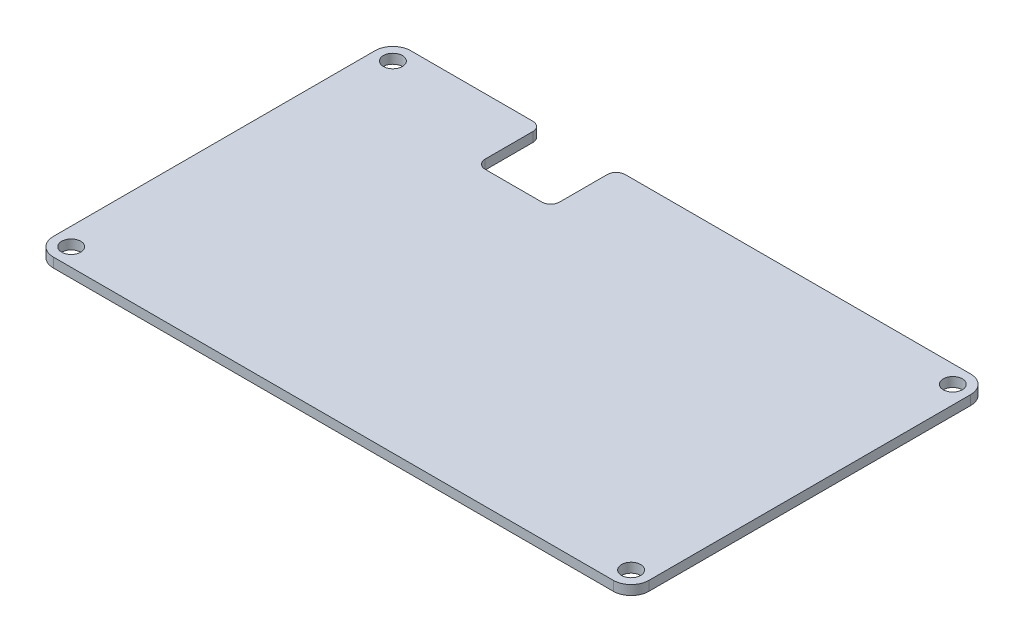
ISO-10303-21;
HEADER;
FILE_DESCRIPTION(('STEP AP214'),'2;1');
FILE_NAME('part.step','',(''),(''),'','','');
FILE_SCHEMA(('AUTOMOTIVE_DESIGN { 1 0 10303 214 1 1 1 1 }'));
ENDSEC;
DATA;
#1=APPLICATION_CONTEXT('core data for automotive mechanical design processes');
#2=APPLICATION_PROTOCOL_DEFINITION('international standard','automotive_design',2000,#1);
#3=PRODUCT_CONTEXT('',#1,'mechanical');
#4=PRODUCT('Part','Part','',(#3));
#5=PRODUCT_RELATED_PRODUCT_CATEGORY('part','',(#4));
#6=PRODUCT_DEFINITION_FORMATION('','',#4);
#7=PRODUCT_DEFINITION_CONTEXT('part definition',#1,'design');
#8=PRODUCT_DEFINITION('design','',#6,#7);
#9=PRODUCT_DEFINITION_SHAPE('','',#8);
#10=(LENGTH_UNIT() NAMED_UNIT(*) SI_UNIT(.MILLI.,.METRE.));
#11=(NAMED_UNIT(*) PLANE_ANGLE_UNIT() SI_UNIT($,.RADIAN.));
#12=(NAMED_UNIT(*) SI_UNIT($,.STERADIAN.) SOLID_ANGLE_UNIT());
#13=UNCERTAINTY_MEASURE_WITH_UNIT(LENGTH_MEASURE(1.E-05),#10,'distance_accuracy_value','');
#14=(GEOMETRIC_REPRESENTATION_CONTEXT(3) GLOBAL_UNCERTAINTY_ASSIGNED_CONTEXT((#13)) GLOBAL_UNIT_ASSIGNED_CONTEXT((#10,
#11,#12)) REPRESENTATION_CONTEXT('',''));
#15=CARTESIAN_POINT('',(0.,0.,0.));
#16=DIRECTION('',(0.,0.,1.));
#17=DIRECTION('',(1.,0.,0.));
#18=AXIS2_PLACEMENT_3D('',#15,#16,#17);
#19=CARTESIAN_POINT('',(-50.,1.6,-30.));
#20=DIRECTION('',(0.,0.,-1.));
#21=DIRECTION('',(-1.,0.,0.));
#22=AXIS2_PLACEMENT_3D('',#19,#20,#21);
#23=PLANE('',#22);
#24=DIRECTION('',(1.,0.,0.));
#25=VECTOR('',#24,1.);
#26=CARTESIAN_POINT('',(-50.,1.6,-30.));
#27=LINE('',#26,#25);
#28=CARTESIAN_POINT('',(-47.,1.6,-30.));
#29=VERTEX_POINT('',#28);
#30=CARTESIAN_POINT('',(-26.5,1.6,-30.));
#31=VERTEX_POINT('',#30);
#32=EDGE_CURVE('E156',#29,#31,#27,.T.);
#33=ORIENTED_EDGE('',*,*,#32,.T.);
#34=DIRECTION('',(0.,1.,0.));
#35=VECTOR('',#34,1.);
#36=CARTESIAN_POINT('',(-26.5,0.,-30.));
#37=LINE('',#36,#35);
#38=CARTESIAN_POINT('',(-26.5,0.,-30.));
#39=VERTEX_POINT('',#38);
#40=EDGE_CURVE('E227',#31,#39,#37,.F.);
#41=ORIENTED_EDGE('',*,*,#40,.T.);
#42=DIRECTION('',(1.,0.,0.));
#43=VECTOR('',#42,1.);
#44=CARTESIAN_POINT('',(-50.,0.,-30.));
#45=LINE('',#44,#43);
#46=CARTESIAN_POINT('',(-47.,0.,-30.));
#47=VERTEX_POINT('',#46);
#48=EDGE_CURVE('E298',#47,#39,#45,.T.);
#49=ORIENTED_EDGE('',*,*,#48,.F.);
#50=DIRECTION('',(0.,-1.,0.));
#51=VECTOR('',#50,1.);
#52=CARTESIAN_POINT('',(-47.,1.6,-30.));
#53=LINE('',#52,#51);
#54=EDGE_CURVE('E206',#47,#29,#53,.F.);
#55=ORIENTED_EDGE('',*,*,#54,.T.);
#56=EDGE_LOOP('',(#33,#41,#49,#55));
#57=FACE_BOUND('',#56,.T.);
#58=ADVANCED_FACE('F33',(#57),#23,.T.);
#59=CARTESIAN_POINT('',(-50.,1.6,30.));
#60=DIRECTION('',(0.,0.,-1.));
#61=DIRECTION('',(-1.,0.,0.));
#62=AXIS2_PLACEMENT_3D('',#59,#60,#61);
#63=PLANE('',#62);
#64=DIRECTION('',(1.,0.,0.));
#65=VECTOR('',#64,1.);
#66=CARTESIAN_POINT('',(-50.,0.,30.));
#67=LINE('',#66,#65);
#68=CARTESIAN_POINT('',(-47.,0.,30.));
#69=VERTEX_POINT('',#68);
#70=CARTESIAN_POINT('',(47.,0.,30.));
#71=VERTEX_POINT('',#70);
#72=EDGE_CURVE('E285',#69,#71,#67,.T.);
#73=ORIENTED_EDGE('',*,*,#72,.T.);
#74=DIRECTION('',(0.,-1.,0.));
#75=VECTOR('',#74,1.);
#76=CARTESIAN_POINT('',(47.,1.6,30.));
#77=LINE('',#76,#75);
#78=CARTESIAN_POINT('',(47.,1.6,30.));
#79=VERTEX_POINT('',#78);
#80=EDGE_CURVE('E199',#71,#79,#77,.F.);
#81=ORIENTED_EDGE('',*,*,#80,.T.);
#82=DIRECTION('',(1.,0.,0.));
#83=VECTOR('',#82,1.);
#84=CARTESIAN_POINT('',(-50.,1.6,30.));
#85=LINE('',#84,#83);
#86=CARTESIAN_POINT('',(-47.,1.6,30.));
#87=VERTEX_POINT('',#86);
#88=EDGE_CURVE('E288',#87,#79,#85,.T.);
#89=ORIENTED_EDGE('',*,*,#88,.F.);
#90=DIRECTION('',(0.,-1.,0.));
#91=VECTOR('',#90,1.);
#92=CARTESIAN_POINT('',(-47.,1.6,30.));
#93=LINE('',#92,#91);
#94=EDGE_CURVE('E166',#87,#69,#93,.T.);
#95=ORIENTED_EDGE('',*,*,#94,.T.);
#96=EDGE_LOOP('',(#73,#81,#89,#95));
#97=FACE_BOUND('',#96,.T.);
#98=ADVANCED_FACE('F326',(#97),#63,.F.);
#99=CARTESIAN_POINT('',(50.,1.6,-30.));
#100=DIRECTION('',(1.,0.,0.));
#101=DIRECTION('',(0.,0.,-1.));
#102=AXIS2_PLACEMENT_3D('',#99,#100,#101);
#103=PLANE('',#102);
#104=DIRECTION('',(0.,0.,1.));
#105=VECTOR('',#104,1.);
#106=CARTESIAN_POINT('',(50.,0.,-30.));
#107=LINE('',#106,#105);
#108=CARTESIAN_POINT('',(50.,0.,-27.));
#109=VERTEX_POINT('',#108);
#110=CARTESIAN_POINT('',(50.,0.,27.));
#111=VERTEX_POINT('',#110);
#112=EDGE_CURVE('E295',#109,#111,#107,.T.);
#113=ORIENTED_EDGE('',*,*,#112,.F.);
#114=DIRECTION('',(0.,-1.,0.));
#115=VECTOR('',#114,1.);
#116=CARTESIAN_POINT('',(50.,1.6,-27.));
#117=LINE('',#116,#115);
#118=CARTESIAN_POINT('',(50.,1.6,-27.));
#119=VERTEX_POINT('',#118);
#120=EDGE_CURVE('E190',#109,#119,#117,.F.);
#121=ORIENTED_EDGE('',*,*,#120,.T.);
#122=DIRECTION('',(0.,0.,1.));
#123=VECTOR('',#122,1.);
#124=CARTESIAN_POINT('',(50.,1.6,-30.));
#125=LINE('',#124,#123);
#126=CARTESIAN_POINT('',(50.,1.6,27.));
#127=VERTEX_POINT('',#126);
#128=EDGE_CURVE('E157',#119,#127,#125,.T.);
#129=ORIENTED_EDGE('',*,*,#128,.T.);
#130=DIRECTION('',(0.,-1.,0.));
#131=VECTOR('',#130,1.);
#132=CARTESIAN_POINT('',(50.,0.,27.));
#133=LINE('',#132,#131);
#134=EDGE_CURVE('E187',#127,#111,#133,.T.);
#135=ORIENTED_EDGE('',*,*,#134,.T.);
#136=EDGE_LOOP('',(#113,#121,#129,#135));
#137=FACE_BOUND('',#136,.T.);
#138=ADVANCED_FACE('F332',(#137),#103,.T.);
#139=CARTESIAN_POINT('',(-11.,0.,-30.));
#140=VERTEX_POINT('',#139);
#141=CARTESIAN_POINT('',(47.,0.,-30.));
#142=VERTEX_POINT('',#141);
#143=EDGE_CURVE('E297',#140,#142,#45,.T.);
#144=ORIENTED_EDGE('',*,*,#143,.F.);
#145=DIRECTION('',(0.,1.,0.));
#146=VECTOR('',#145,1.);
#147=CARTESIAN_POINT('',(-11.,1.6,-30.));
#148=LINE('',#147,#146);
#149=CARTESIAN_POINT('',(-11.,1.6,-30.));
#150=VERTEX_POINT('',#149);
#151=EDGE_CURVE('E154',#140,#150,#148,.T.);
#152=ORIENTED_EDGE('',*,*,#151,.T.);
#153=CARTESIAN_POINT('',(47.,1.6,-30.));
#154=VERTEX_POINT('',#153);
#155=EDGE_CURVE('E147',#150,#154,#27,.T.);
#156=ORIENTED_EDGE('',*,*,#155,.T.);
#157=DIRECTION('',(0.,-1.,0.));
#158=VECTOR('',#157,1.);
#159=CARTESIAN_POINT('',(47.,1.6,-30.));
#160=LINE('',#159,#158);
#161=EDGE_CURVE('E152',#154,#142,#160,.T.);
#162=ORIENTED_EDGE('',*,*,#161,.T.);
#163=EDGE_LOOP('',(#144,#152,#156,#162));
#164=FACE_BOUND('',#163,.T.);
#165=ADVANCED_FACE('F150',(#164),#23,.T.);
#166=CARTESIAN_POINT('',(-50.,1.6,-30.));
#167=DIRECTION('',(1.,0.,0.));
#168=DIRECTION('',(0.,0.,-1.));
#169=AXIS2_PLACEMENT_3D('',#166,#167,#168);
#170=PLANE('',#169);
#171=DIRECTION('',(0.,0.,1.));
#172=VECTOR('',#171,1.);
#173=CARTESIAN_POINT('',(-50.,0.,-30.));
#174=LINE('',#173,#172);
#175=CARTESIAN_POINT('',(-50.,0.,-27.));
#176=VERTEX_POINT('',#175);
#177=CARTESIAN_POINT('',(-50.,0.,27.));
#178=VERTEX_POINT('',#177);
#179=EDGE_CURVE('E180',#176,#178,#174,.T.);
#180=ORIENTED_EDGE('',*,*,#179,.T.);
#181=DIRECTION('',(0.,-1.,0.));
#182=VECTOR('',#181,1.);
#183=CARTESIAN_POINT('',(-50.,1.6,27.));
#184=LINE('',#183,#182);
#185=CARTESIAN_POINT('',(-50.,1.6,27.));
#186=VERTEX_POINT('',#185);
#187=EDGE_CURVE('E204',#178,#186,#184,.F.);
#188=ORIENTED_EDGE('',*,*,#187,.T.);
#189=DIRECTION('',(0.,0.,1.));
#190=VECTOR('',#189,1.);
#191=CARTESIAN_POINT('',(-50.,1.6,-30.));
#192=LINE('',#191,#190);
#193=CARTESIAN_POINT('',(-50.,1.6,-27.));
#194=VERTEX_POINT('',#193);
#195=EDGE_CURVE('E173',#194,#186,#192,.T.);
#196=ORIENTED_EDGE('',*,*,#195,.F.);
#197=DIRECTION('',(0.,-1.,0.));
#198=VECTOR('',#197,1.);
#199=CARTESIAN_POINT('',(-50.,0.,-27.));
#200=LINE('',#199,#198);
#201=EDGE_CURVE('E201',#194,#176,#200,.T.);
#202=ORIENTED_EDGE('',*,*,#201,.T.);
#203=EDGE_LOOP('',(#180,#188,#196,#202));
#204=FACE_BOUND('',#203,.T.);
#205=ADVANCED_FACE('F338',(#204),#170,.F.);
#206=CARTESIAN_POINT('',(0.,1.6,0.));
#207=DIRECTION('',(0.,-1.,0.));
#208=DIRECTION('',(0.,0.,-1.));
#209=AXIS2_PLACEMENT_3D('',#206,#207,#208);
#210=PLANE('',#209);
#211=CARTESIAN_POINT('',(-47.,1.6,27.));
#212=DIRECTION('',(0.,1.,0.));
#213=DIRECTION('',(0.,0.,-1.));
#214=AXIS2_PLACEMENT_3D('',#211,#212,#213);
#215=CIRCLE('',#214,1.6);
#216=CARTESIAN_POINT('',(-47.,1.6,25.4));
#217=VERTEX_POINT('',#216);
#218=EDGE_CURVE('E256',#217,#217,#215,.T.);
#219=ORIENTED_EDGE('',*,*,#218,.F.);
#220=EDGE_LOOP('',(#219));
#221=FACE_BOUND('',#220,.T.);
#222=CARTESIAN_POINT('',(47.,1.6,27.));
#223=DIRECTION('',(0.,1.,0.));
#224=DIRECTION('',(0.,0.,1.));
#225=AXIS2_PLACEMENT_3D('',#222,#223,#224);
#226=CIRCLE('',#225,1.6);
#227=CARTESIAN_POINT('',(47.,1.6,28.6));
#228=VERTEX_POINT('',#227);
#229=EDGE_CURVE('E274',#228,#228,#226,.T.);
#230=ORIENTED_EDGE('',*,*,#229,.F.);
#231=EDGE_LOOP('',(#230));
#232=FACE_BOUND('',#231,.T.);
#233=CARTESIAN_POINT('',(47.,1.6,-27.));
#234=DIRECTION('',(0.,1.,0.));
#235=DIRECTION('',(0.,0.,-1.));
#236=AXIS2_PLACEMENT_3D('',#233,#234,#235);
#237=CIRCLE('',#236,1.6);
#238=CARTESIAN_POINT('',(47.,1.6,-28.6));
#239=VERTEX_POINT('',#238);
#240=EDGE_CURVE('E268',#239,#239,#237,.T.);
#241=ORIENTED_EDGE('',*,*,#240,.F.);
#242=EDGE_LOOP('',(#241));
#243=FACE_BOUND('',#242,.T.);
#244=CARTESIAN_POINT('',(-47.,1.6,-27.));
#245=DIRECTION('',(0.,1.,0.));
#246=DIRECTION('',(0.,0.,1.));
#247=AXIS2_PLACEMENT_3D('',#244,#245,#246);
#248=CIRCLE('',#247,1.6);
#249=CARTESIAN_POINT('',(-47.,1.6,-25.4));
#250=VERTEX_POINT('',#249);
#251=EDGE_CURVE('E267',#250,#250,#248,.T.);
#252=ORIENTED_EDGE('',*,*,#251,.F.);
#253=EDGE_LOOP('',(#252));
#254=FACE_BOUND('',#253,.T.);
#255=ORIENTED_EDGE('',*,*,#155,.F.);
#256=CARTESIAN_POINT('',(-11.,1.6,-28.5));
#257=DIRECTION('',(0.,-1.,0.));
#258=DIRECTION('',(0.,0.,-1.));
#259=AXIS2_PLACEMENT_3D('',#256,#257,#258);
#260=CIRCLE('',#259,1.5);
#261=CARTESIAN_POINT('',(-12.5,1.6,-28.5));
#262=VERTEX_POINT('',#261);
#263=EDGE_CURVE('E211',#150,#262,#260,.F.);
#264=ORIENTED_EDGE('',*,*,#263,.T.);
#265=DIRECTION('',(0.,0.,-1.));
#266=VECTOR('',#265,1.);
#267=CARTESIAN_POINT('',(-12.5,1.6,-30.));
#268=LINE('',#267,#266);
#269=CARTESIAN_POINT('',(-12.5,1.6,-20.5));
#270=VERTEX_POINT('',#269);
#271=EDGE_CURVE('E258',#270,#262,#268,.T.);
#272=ORIENTED_EDGE('',*,*,#271,.F.);
#273=CARTESIAN_POINT('',(-14.,1.6,-20.5));
#274=DIRECTION('',(0.,-1.,0.));
#275=DIRECTION('',(0.,0.,-1.));
#276=AXIS2_PLACEMENT_3D('',#273,#274,#275);
#277=CIRCLE('',#276,1.5);
#278=CARTESIAN_POINT('',(-14.,1.6,-19.));
#279=VERTEX_POINT('',#278);
#280=EDGE_CURVE('E233',#270,#279,#277,.T.);
#281=ORIENTED_EDGE('',*,*,#280,.T.);
#282=DIRECTION('',(1.,0.,0.));
#283=VECTOR('',#282,1.);
#284=CARTESIAN_POINT('',(-25.,1.6,-19.));
#285=LINE('',#284,#283);
#286=CARTESIAN_POINT('',(-23.5,1.6,-19.));
#287=VERTEX_POINT('',#286);
#288=EDGE_CURVE('E240',#287,#279,#285,.T.);
#289=ORIENTED_EDGE('',*,*,#288,.F.);
#290=CARTESIAN_POINT('',(-23.5,1.6,-20.5));
#291=DIRECTION('',(0.,-1.,0.));
#292=DIRECTION('',(0.,0.,-1.));
#293=AXIS2_PLACEMENT_3D('',#290,#291,#292);
#294=CIRCLE('',#293,1.5);
#295=CARTESIAN_POINT('',(-25.,1.6,-20.5));
#296=VERTEX_POINT('',#295);
#297=EDGE_CURVE('E41',#287,#296,#294,.T.);
#298=ORIENTED_EDGE('',*,*,#297,.T.);
#299=DIRECTION('',(0.,0.,1.));
#300=VECTOR('',#299,1.);
#301=CARTESIAN_POINT('',(-25.,1.6,-30.));
#302=LINE('',#301,#300);
#303=CARTESIAN_POINT('',(-25.,1.6,-28.5));
#304=VERTEX_POINT('',#303);
#305=EDGE_CURVE('E239',#304,#296,#302,.T.);
#306=ORIENTED_EDGE('',*,*,#305,.F.);
#307=CARTESIAN_POINT('',(-26.5,1.6,-28.5));
#308=DIRECTION('',(0.,-1.,0.));
#309=DIRECTION('',(0.,0.,-1.));
#310=AXIS2_PLACEMENT_3D('',#307,#308,#309);
#311=CIRCLE('',#310,1.5);
#312=EDGE_CURVE('E209',#304,#31,#311,.F.);
#313=ORIENTED_EDGE('',*,*,#312,.T.);
#314=ORIENTED_EDGE('',*,*,#32,.F.);
#315=CARTESIAN_POINT('',(-47.,1.6,-27.));
#316=DIRECTION('',(0.,-1.,0.));
#317=DIRECTION('',(0.,0.,-1.));
#318=AXIS2_PLACEMENT_3D('',#315,#316,#317);
#319=CIRCLE('',#318,3.);
#320=EDGE_CURVE('E192',#29,#194,#319,.F.);
#321=ORIENTED_EDGE('',*,*,#320,.T.);
#322=ORIENTED_EDGE('',*,*,#195,.T.);
#323=CARTESIAN_POINT('',(-47.,1.6,27.));
#324=DIRECTION('',(0.,-1.,0.));
#325=DIRECTION('',(0.,0.,-1.));
#326=AXIS2_PLACEMENT_3D('',#323,#324,#325);
#327=CIRCLE('',#326,3.);
#328=EDGE_CURVE('E194',#186,#87,#327,.F.);
#329=ORIENTED_EDGE('',*,*,#328,.T.);
#330=ORIENTED_EDGE('',*,*,#88,.T.);
#331=CARTESIAN_POINT('',(47.,1.6,27.));
#332=DIRECTION('',(0.,-1.,0.));
#333=DIRECTION('',(0.,0.,-1.));
#334=AXIS2_PLACEMENT_3D('',#331,#332,#333);
#335=CIRCLE('',#334,3.);
#336=EDGE_CURVE('E167',#79,#127,#335,.F.);
#337=ORIENTED_EDGE('',*,*,#336,.T.);
#338=ORIENTED_EDGE('',*,*,#128,.F.);
#339=CARTESIAN_POINT('',(47.,1.6,-27.));
#340=DIRECTION('',(0.,-1.,0.));
#341=DIRECTION('',(0.,0.,-1.));
#342=AXIS2_PLACEMENT_3D('',#339,#340,#341);
#343=CIRCLE('',#342,3.);
#344=EDGE_CURVE('E161',#119,#154,#343,.F.);
#345=ORIENTED_EDGE('',*,*,#344,.T.);
#346=EDGE_LOOP('',(#255,#264,#272,#281,#289,#298,#306,#313,#314,#321,#322,#329,#330,#337,#338,#345));
#347=FACE_BOUND('',#346,.T.);
#348=ADVANCED_FACE('F162',(#221,#232,#243,#254,#347),#210,.F.);
#349=CARTESIAN_POINT('',(0.,0.,0.));
#350=DIRECTION('',(0.,-1.,0.));
#351=DIRECTION('',(0.,0.,-1.));
#352=AXIS2_PLACEMENT_3D('',#349,#350,#351);
#353=PLANE('',#352);
#354=DIRECTION('',(0.,0.,-1.));
#355=VECTOR('',#354,1.);
#356=CARTESIAN_POINT('',(-12.5,0.,-30.));
#357=LINE('',#356,#355);
#358=CARTESIAN_POINT('',(-12.5,0.,-20.5));
#359=VERTEX_POINT('',#358);
#360=CARTESIAN_POINT('',(-12.5,0.,-28.5));
#361=VERTEX_POINT('',#360);
#362=EDGE_CURVE('E252',#359,#361,#357,.T.);
#363=ORIENTED_EDGE('',*,*,#362,.T.);
#364=CARTESIAN_POINT('',(-11.,0.,-28.5));
#365=DIRECTION('',(0.,-1.,0.));
#366=DIRECTION('',(0.,0.,-1.));
#367=AXIS2_PLACEMENT_3D('',#364,#365,#366);
#368=CIRCLE('',#367,1.5);
#369=EDGE_CURVE('E220',#361,#140,#368,.T.);
#370=ORIENTED_EDGE('',*,*,#369,.T.);
#371=ORIENTED_EDGE('',*,*,#143,.T.);
#372=CARTESIAN_POINT('',(47.,0.,-27.));
#373=DIRECTION('',(0.,-1.,0.));
#374=DIRECTION('',(0.,0.,-1.));
#375=AXIS2_PLACEMENT_3D('',#372,#373,#374);
#376=CIRCLE('',#375,3.);
#377=EDGE_CURVE('E171',#142,#109,#376,.T.);
#378=ORIENTED_EDGE('',*,*,#377,.T.);
#379=ORIENTED_EDGE('',*,*,#112,.T.);
#380=CARTESIAN_POINT('',(47.,0.,27.));
#381=DIRECTION('',(0.,-1.,0.));
#382=DIRECTION('',(0.,0.,-1.));
#383=AXIS2_PLACEMENT_3D('',#380,#381,#382);
#384=CIRCLE('',#383,3.);
#385=EDGE_CURVE('E184',#111,#71,#384,.T.);
#386=ORIENTED_EDGE('',*,*,#385,.T.);
#387=ORIENTED_EDGE('',*,*,#72,.F.);
#388=CARTESIAN_POINT('',(-47.,0.,27.));
#389=DIRECTION('',(0.,-1.,0.));
#390=DIRECTION('',(0.,0.,-1.));
#391=AXIS2_PLACEMENT_3D('',#388,#389,#390);
#392=CIRCLE('',#391,3.);
#393=EDGE_CURVE('E175',#69,#178,#392,.T.);
#394=ORIENTED_EDGE('',*,*,#393,.T.);
#395=ORIENTED_EDGE('',*,*,#179,.F.);
#396=CARTESIAN_POINT('',(-47.,0.,-27.));
#397=DIRECTION('',(0.,-1.,0.));
#398=DIRECTION('',(0.,0.,-1.));
#399=AXIS2_PLACEMENT_3D('',#396,#397,#398);
#400=CIRCLE('',#399,3.);
#401=EDGE_CURVE('E172',#176,#47,#400,.T.);
#402=ORIENTED_EDGE('',*,*,#401,.T.);
#403=ORIENTED_EDGE('',*,*,#48,.T.);
#404=CARTESIAN_POINT('',(-26.5,0.,-28.5));
#405=DIRECTION('',(0.,-1.,0.));
#406=DIRECTION('',(0.,0.,-1.));
#407=AXIS2_PLACEMENT_3D('',#404,#405,#406);
#408=CIRCLE('',#407,1.5);
#409=CARTESIAN_POINT('',(-25.,0.,-28.5));
#410=VERTEX_POINT('',#409);
#411=EDGE_CURVE('E218',#39,#410,#408,.T.);
#412=ORIENTED_EDGE('',*,*,#411,.T.);
#413=DIRECTION('',(0.,0.,1.));
#414=VECTOR('',#413,1.);
#415=CARTESIAN_POINT('',(-25.,0.,-30.));
#416=LINE('',#415,#414);
#417=CARTESIAN_POINT('',(-25.,0.,-20.5));
#418=VERTEX_POINT('',#417);
#419=EDGE_CURVE('E253',#410,#418,#416,.T.);
#420=ORIENTED_EDGE('',*,*,#419,.T.);
#421=CARTESIAN_POINT('',(-23.5,0.,-20.5));
#422=DIRECTION('',(0.,-1.,0.));
#423=DIRECTION('',(0.,0.,-1.));
#424=AXIS2_PLACEMENT_3D('',#421,#422,#423);
#425=CIRCLE('',#424,1.5);
#426=CARTESIAN_POINT('',(-23.5,0.,-19.));
#427=VERTEX_POINT('',#426);
#428=EDGE_CURVE('E11',#418,#427,#425,.F.);
#429=ORIENTED_EDGE('',*,*,#428,.T.);
#430=DIRECTION('',(1.,0.,0.));
#431=VECTOR('',#430,1.);
#432=CARTESIAN_POINT('',(-25.,0.,-19.));
#433=LINE('',#432,#431);
#434=CARTESIAN_POINT('',(-14.,0.,-19.));
#435=VERTEX_POINT('',#434);
#436=EDGE_CURVE('E250',#427,#435,#433,.T.);
#437=ORIENTED_EDGE('',*,*,#436,.T.);
#438=CARTESIAN_POINT('',(-14.,0.,-20.5));
#439=DIRECTION('',(0.,-1.,0.));
#440=DIRECTION('',(0.,0.,-1.));
#441=AXIS2_PLACEMENT_3D('',#438,#439,#440);
#442=CIRCLE('',#441,1.5);
#443=EDGE_CURVE('E235',#435,#359,#442,.F.);
#444=ORIENTED_EDGE('',*,*,#443,.T.);
#445=EDGE_LOOP('',(#363,#370,#371,#378,#379,#386,#387,#394,#395,#402,#403,#412,#420,#429,#437,#444));
#446=FACE_BOUND('',#445,.T.);
#447=CARTESIAN_POINT('',(-47.,0.,27.));
#448=DIRECTION('',(0.,1.,0.));
#449=DIRECTION('',(0.,0.,-1.));
#450=AXIS2_PLACEMENT_3D('',#447,#448,#449);
#451=CIRCLE('',#450,1.6);
#452=CARTESIAN_POINT('',(-47.,0.,25.4));
#453=VERTEX_POINT('',#452);
#454=EDGE_CURVE('E277',#453,#453,#451,.T.);
#455=ORIENTED_EDGE('',*,*,#454,.T.);
#456=EDGE_LOOP('',(#455));
#457=FACE_BOUND('',#456,.T.);
#458=CARTESIAN_POINT('',(47.,0.,27.));
#459=DIRECTION('',(0.,1.,0.));
#460=DIRECTION('',(0.,0.,1.));
#461=AXIS2_PLACEMENT_3D('',#458,#459,#460);
#462=CIRCLE('',#461,1.6);
#463=CARTESIAN_POINT('',(47.,0.,28.6));
#464=VERTEX_POINT('',#463);
#465=EDGE_CURVE('E271',#464,#464,#462,.T.);
#466=ORIENTED_EDGE('',*,*,#465,.T.);
#467=EDGE_LOOP('',(#466));
#468=FACE_BOUND('',#467,.T.);
#469=CARTESIAN_POINT('',(47.,0.,-27.));
#470=DIRECTION('',(0.,1.,0.));
#471=DIRECTION('',(0.,0.,-1.));
#472=AXIS2_PLACEMENT_3D('',#469,#470,#471);
#473=CIRCLE('',#472,1.6);
#474=CARTESIAN_POINT('',(47.,0.,-28.6));
#475=VERTEX_POINT('',#474);
#476=EDGE_CURVE('E264',#475,#475,#473,.T.);
#477=ORIENTED_EDGE('',*,*,#476,.T.);
#478=EDGE_LOOP('',(#477));
#479=FACE_BOUND('',#478,.T.);
#480=CARTESIAN_POINT('',(-47.,0.,-27.));
#481=DIRECTION('',(0.,1.,0.));
#482=DIRECTION('',(0.,0.,1.));
#483=AXIS2_PLACEMENT_3D('',#480,#481,#482);
#484=CIRCLE('',#483,1.6);
#485=CARTESIAN_POINT('',(-47.,0.,-25.4));
#486=VERTEX_POINT('',#485);
#487=EDGE_CURVE('E282',#486,#486,#484,.T.);
#488=ORIENTED_EDGE('',*,*,#487,.T.);
#489=EDGE_LOOP('',(#488));
#490=FACE_BOUND('',#489,.T.);
#491=ADVANCED_FACE('F303',(#446,#457,#468,#479,#490),#353,.T.);
#492=CARTESIAN_POINT('',(-47.,0.,-27.));
#493=DIRECTION('',(0.,1.,0.));
#494=DIRECTION('',(0.,0.,1.));
#495=AXIS2_PLACEMENT_3D('',#492,#493,#494);
#496=CYLINDRICAL_SURFACE('',#495,1.6);
#497=ORIENTED_EDGE('',*,*,#487,.F.);
#498=EDGE_LOOP('',(#497));
#499=FACE_BOUND('',#498,.T.);
#500=ORIENTED_EDGE('',*,*,#251,.T.);
#501=EDGE_LOOP('',(#500));
#502=FACE_BOUND('',#501,.T.);
#503=ADVANCED_FACE('F459',(#499,#502),#496,.F.);
#504=CARTESIAN_POINT('',(47.,0.,-27.));
#505=DIRECTION('',(0.,1.,0.));
#506=DIRECTION('',(0.,0.,1.));
#507=AXIS2_PLACEMENT_3D('',#504,#505,#506);
#508=CYLINDRICAL_SURFACE('',#507,1.6);
#509=ORIENTED_EDGE('',*,*,#476,.F.);
#510=EDGE_LOOP('',(#509));
#511=FACE_BOUND('',#510,.T.);
#512=ORIENTED_EDGE('',*,*,#240,.T.);
#513=EDGE_LOOP('',(#512));
#514=FACE_BOUND('',#513,.T.);
#515=ADVANCED_FACE('F450',(#511,#514),#508,.F.);
#516=CARTESIAN_POINT('',(47.,0.,27.));
#517=DIRECTION('',(0.,1.,0.));
#518=DIRECTION('',(0.,0.,1.));
#519=AXIS2_PLACEMENT_3D('',#516,#517,#518);
#520=CYLINDRICAL_SURFACE('',#519,1.6);
#521=ORIENTED_EDGE('',*,*,#465,.F.);
#522=EDGE_LOOP('',(#521));
#523=FACE_BOUND('',#522,.T.);
#524=ORIENTED_EDGE('',*,*,#229,.T.);
#525=EDGE_LOOP('',(#524));
#526=FACE_BOUND('',#525,.T.);
#527=ADVANCED_FACE('F440',(#523,#526),#520,.F.);
#528=CARTESIAN_POINT('',(-47.,0.,27.));
#529=DIRECTION('',(0.,1.,0.));
#530=DIRECTION('',(0.,0.,1.));
#531=AXIS2_PLACEMENT_3D('',#528,#529,#530);
#532=CYLINDRICAL_SURFACE('',#531,1.6);
#533=ORIENTED_EDGE('',*,*,#454,.F.);
#534=EDGE_LOOP('',(#533));
#535=FACE_BOUND('',#534,.T.);
#536=ORIENTED_EDGE('',*,*,#218,.T.);
#537=EDGE_LOOP('',(#536));
#538=FACE_BOUND('',#537,.T.);
#539=ADVANCED_FACE('F427',(#535,#538),#532,.F.);
#540=CARTESIAN_POINT('',(-25.,0.,-30.));
#541=DIRECTION('',(-1.,0.,0.));
#542=DIRECTION('',(0.,0.,1.));
#543=AXIS2_PLACEMENT_3D('',#540,#541,#542);
#544=PLANE('',#543);
#545=ORIENTED_EDGE('',*,*,#419,.F.);
#546=DIRECTION('',(0.,1.,0.));
#547=VECTOR('',#546,1.);
#548=CARTESIAN_POINT('',(-25.,1.6,-28.5));
#549=LINE('',#548,#547);
#550=EDGE_CURVE('E224',#410,#304,#549,.T.);
#551=ORIENTED_EDGE('',*,*,#550,.T.);
#552=ORIENTED_EDGE('',*,*,#305,.T.);
#553=DIRECTION('',(0.,1.,0.));
#554=VECTOR('',#553,1.);
#555=CARTESIAN_POINT('',(-25.,0.,-20.5));
#556=LINE('',#555,#554);
#557=EDGE_CURVE('E222',#296,#418,#556,.F.);
#558=ORIENTED_EDGE('',*,*,#557,.T.);
#559=EDGE_LOOP('',(#545,#551,#552,#558));
#560=FACE_BOUND('',#559,.T.);
#561=ADVANCED_FACE('F246',(#560),#544,.F.);
#562=CARTESIAN_POINT('',(-12.5,0.,-30.));
#563=DIRECTION('',(1.,0.,0.));
#564=DIRECTION('',(0.,0.,-1.));
#565=AXIS2_PLACEMENT_3D('',#562,#563,#564);
#566=PLANE('',#565);
#567=ORIENTED_EDGE('',*,*,#271,.T.);
#568=DIRECTION('',(0.,1.,0.));
#569=VECTOR('',#568,1.);
#570=CARTESIAN_POINT('',(-12.5,0.,-28.5));
#571=LINE('',#570,#569);
#572=EDGE_CURVE('E216',#262,#361,#571,.F.);
#573=ORIENTED_EDGE('',*,*,#572,.T.);
#574=ORIENTED_EDGE('',*,*,#362,.F.);
#575=DIRECTION('',(0.,1.,0.));
#576=VECTOR('',#575,1.);
#577=CARTESIAN_POINT('',(-12.5,1.6,-20.5));
#578=LINE('',#577,#576);
#579=EDGE_CURVE('E213',#359,#270,#578,.T.);
#580=ORIENTED_EDGE('',*,*,#579,.T.);
#581=EDGE_LOOP('',(#567,#573,#574,#580));
#582=FACE_BOUND('',#581,.T.);
#583=ADVANCED_FACE('F312',(#582),#566,.F.);
#584=CARTESIAN_POINT('',(-25.,0.,-19.));
#585=DIRECTION('',(0.,0.,1.));
#586=DIRECTION('',(1.,0.,0.));
#587=AXIS2_PLACEMENT_3D('',#584,#585,#586);
#588=PLANE('',#587);
#589=ORIENTED_EDGE('',*,*,#288,.T.);
#590=DIRECTION('',(0.,1.,0.));
#591=VECTOR('',#590,1.);
#592=CARTESIAN_POINT('',(-14.,0.,-19.));
#593=LINE('',#592,#591);
#594=EDGE_CURVE('E48',#279,#435,#593,.F.);
#595=ORIENTED_EDGE('',*,*,#594,.T.);
#596=ORIENTED_EDGE('',*,*,#436,.F.);
#597=DIRECTION('',(0.,1.,0.));
#598=VECTOR('',#597,1.);
#599=CARTESIAN_POINT('',(-23.5,1.6,-19.));
#600=LINE('',#599,#598);
#601=EDGE_CURVE('E229',#427,#287,#600,.T.);
#602=ORIENTED_EDGE('',*,*,#601,.T.);
#603=EDGE_LOOP('',(#589,#595,#596,#602));
#604=FACE_BOUND('',#603,.T.);
#605=ADVANCED_FACE('F249',(#604),#588,.F.);
#606=CARTESIAN_POINT('',(47.,1.6,-27.));
#607=DIRECTION('',(0.,-1.,0.));
#608=DIRECTION('',(0.,0.,-1.));
#609=AXIS2_PLACEMENT_3D('',#606,#607,#608);
#610=CYLINDRICAL_SURFACE('',#609,3.);
#611=ORIENTED_EDGE('',*,*,#344,.F.);
#612=ORIENTED_EDGE('',*,*,#120,.F.);
#613=ORIENTED_EDGE('',*,*,#377,.F.);
#614=ORIENTED_EDGE('',*,*,#161,.F.);
#615=EDGE_LOOP('',(#611,#612,#613,#614));
#616=FACE_BOUND('',#615,.T.);
#617=ADVANCED_FACE('F170',(#616),#610,.T.);
#618=CARTESIAN_POINT('',(47.,1.6,27.));
#619=DIRECTION('',(0.,1.,0.));
#620=DIRECTION('',(0.,0.,1.));
#621=AXIS2_PLACEMENT_3D('',#618,#619,#620);
#622=CYLINDRICAL_SURFACE('',#621,3.);
#623=ORIENTED_EDGE('',*,*,#336,.F.);
#624=ORIENTED_EDGE('',*,*,#80,.F.);
#625=ORIENTED_EDGE('',*,*,#385,.F.);
#626=ORIENTED_EDGE('',*,*,#134,.F.);
#627=EDGE_LOOP('',(#623,#624,#625,#626));
#628=FACE_BOUND('',#627,.T.);
#629=ADVANCED_FACE('F350',(#628),#622,.T.);
#630=CARTESIAN_POINT('',(-47.,1.6,27.));
#631=DIRECTION('',(0.,-1.,0.));
#632=DIRECTION('',(0.,0.,-1.));
#633=AXIS2_PLACEMENT_3D('',#630,#631,#632);
#634=CYLINDRICAL_SURFACE('',#633,3.);
#635=ORIENTED_EDGE('',*,*,#328,.F.);
#636=ORIENTED_EDGE('',*,*,#187,.F.);
#637=ORIENTED_EDGE('',*,*,#393,.F.);
#638=ORIENTED_EDGE('',*,*,#94,.F.);
#639=EDGE_LOOP('',(#635,#636,#637,#638));
#640=FACE_BOUND('',#639,.T.);
#641=ADVANCED_FACE('F353',(#640),#634,.T.);
#642=CARTESIAN_POINT('',(-47.,1.6,-27.));
#643=DIRECTION('',(0.,1.,0.));
#644=DIRECTION('',(0.,0.,1.));
#645=AXIS2_PLACEMENT_3D('',#642,#643,#644);
#646=CYLINDRICAL_SURFACE('',#645,3.);
#647=ORIENTED_EDGE('',*,*,#320,.F.);
#648=ORIENTED_EDGE('',*,*,#54,.F.);
#649=ORIENTED_EDGE('',*,*,#401,.F.);
#650=ORIENTED_EDGE('',*,*,#201,.F.);
#651=EDGE_LOOP('',(#647,#648,#649,#650));
#652=FACE_BOUND('',#651,.T.);
#653=ADVANCED_FACE('F357',(#652),#646,.T.);
#654=CARTESIAN_POINT('',(-11.,1.6,-28.5));
#655=DIRECTION('',(0.,-1.,0.));
#656=DIRECTION('',(0.,0.,-1.));
#657=AXIS2_PLACEMENT_3D('',#654,#655,#656);
#658=CYLINDRICAL_SURFACE('',#657,1.5);
#659=ORIENTED_EDGE('',*,*,#369,.F.);
#660=ORIENTED_EDGE('',*,*,#572,.F.);
#661=ORIENTED_EDGE('',*,*,#263,.F.);
#662=ORIENTED_EDGE('',*,*,#151,.F.);
#663=EDGE_LOOP('',(#659,#660,#661,#662));
#664=FACE_BOUND('',#663,.T.);
#665=ADVANCED_FACE('F308',(#664),#658,.T.);
#666=CARTESIAN_POINT('',(-26.5,0.,-28.5));
#667=DIRECTION('',(0.,-1.,0.));
#668=DIRECTION('',(0.,0.,-1.));
#669=AXIS2_PLACEMENT_3D('',#666,#667,#668);
#670=CYLINDRICAL_SURFACE('',#669,1.5);
#671=ORIENTED_EDGE('',*,*,#411,.F.);
#672=ORIENTED_EDGE('',*,*,#40,.F.);
#673=ORIENTED_EDGE('',*,*,#312,.F.);
#674=ORIENTED_EDGE('',*,*,#550,.F.);
#675=EDGE_LOOP('',(#671,#672,#673,#674));
#676=FACE_BOUND('',#675,.T.);
#677=ADVANCED_FACE('F318',(#676),#670,.T.);
#678=CARTESIAN_POINT('',(-14.,0.,-20.5));
#679=DIRECTION('',(0.,-1.,0.));
#680=DIRECTION('',(0.,0.,-1.));
#681=AXIS2_PLACEMENT_3D('',#678,#679,#680);
#682=CYLINDRICAL_SURFACE('',#681,1.5);
#683=ORIENTED_EDGE('',*,*,#443,.F.);
#684=ORIENTED_EDGE('',*,*,#594,.F.);
#685=ORIENTED_EDGE('',*,*,#280,.F.);
#686=ORIENTED_EDGE('',*,*,#579,.F.);
#687=EDGE_LOOP('',(#683,#684,#685,#686));
#688=FACE_BOUND('',#687,.T.);
#689=ADVANCED_FACE('F316',(#688),#682,.F.);
#690=CARTESIAN_POINT('',(-23.5,0.,-20.5));
#691=DIRECTION('',(0.,-1.,0.));
#692=DIRECTION('',(0.,0.,-1.));
#693=AXIS2_PLACEMENT_3D('',#690,#691,#692);
#694=CYLINDRICAL_SURFACE('',#693,1.5);
#695=ORIENTED_EDGE('',*,*,#428,.F.);
#696=ORIENTED_EDGE('',*,*,#557,.F.);
#697=ORIENTED_EDGE('',*,*,#297,.F.);
#698=ORIENTED_EDGE('',*,*,#601,.F.);
#699=EDGE_LOOP('',(#695,#696,#697,#698));
#700=FACE_BOUND('',#699,.T.);
#701=ADVANCED_FACE('F35',(#700),#694,.F.);
#702=CLOSED_SHELL('',(#58,#98,#138,#165,#205,#348,#491,#503,#515,#527,#539,#561,#583,#605,#617,
#629,#641,#653,#665,#677,#689,#701));
#703=MANIFOLD_SOLID_BREP('B2',#702);
#704=ADVANCED_BREP_SHAPE_REPRESENTATION('',(#18,#703),#14);
#705=SHAPE_DEFINITION_REPRESENTATION(#9,#704);
ENDSEC;
END-ISO-10303-21;
